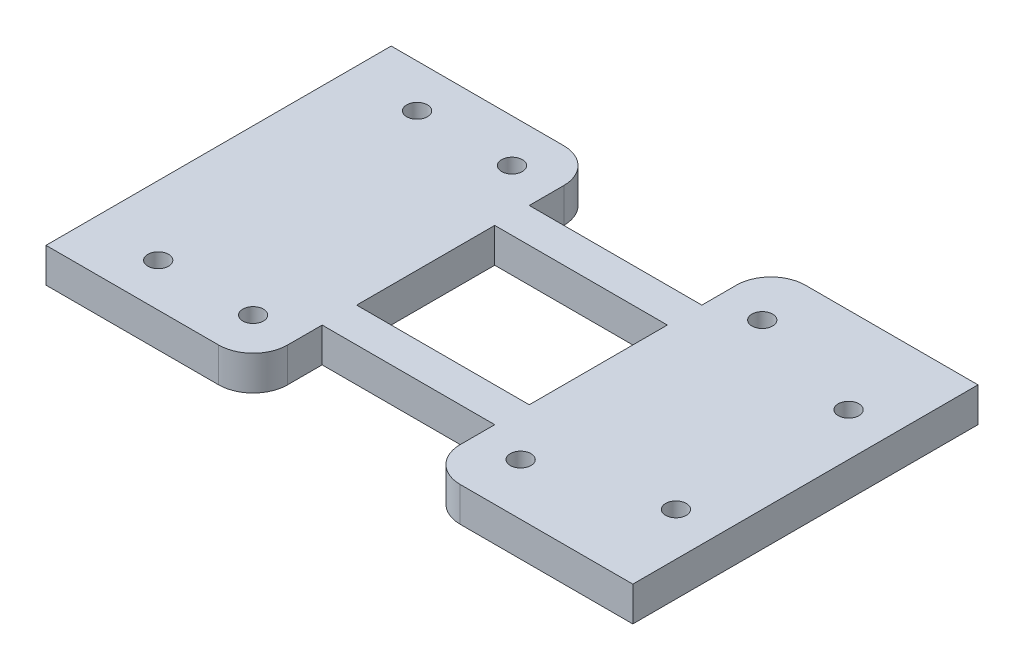
ISO-10303-21;
HEADER;
FILE_DESCRIPTION(('STEP AP214'),'2;1');
FILE_NAME('part.step','',(''),(''),'','','');
FILE_SCHEMA(('AUTOMOTIVE_DESIGN { 1 0 10303 214 1 1 1 1 }'));
ENDSEC;
DATA;
#1=APPLICATION_CONTEXT('core data for automotive mechanical design processes');
#2=APPLICATION_PROTOCOL_DEFINITION('international standard','automotive_design',2000,#1);
#3=PRODUCT_CONTEXT('',#1,'mechanical');
#4=PRODUCT('Part','Part','',(#3));
#5=PRODUCT_RELATED_PRODUCT_CATEGORY('part','',(#4));
#6=PRODUCT_DEFINITION_FORMATION('','',#4);
#7=PRODUCT_DEFINITION_CONTEXT('part definition',#1,'design');
#8=PRODUCT_DEFINITION('design','',#6,#7);
#9=PRODUCT_DEFINITION_SHAPE('','',#8);
#10=(LENGTH_UNIT() NAMED_UNIT(*) SI_UNIT(.MILLI.,.METRE.));
#11=(NAMED_UNIT(*) PLANE_ANGLE_UNIT() SI_UNIT($,.RADIAN.));
#12=(NAMED_UNIT(*) SI_UNIT($,.STERADIAN.) SOLID_ANGLE_UNIT());
#13=UNCERTAINTY_MEASURE_WITH_UNIT(LENGTH_MEASURE(1.E-05),#10,'distance_accuracy_value','');
#14=(GEOMETRIC_REPRESENTATION_CONTEXT(3) GLOBAL_UNCERTAINTY_ASSIGNED_CONTEXT((#13)) GLOBAL_UNIT_ASSIGNED_CONTEXT((#10,
#11,#12)) REPRESENTATION_CONTEXT('',''));
#15=CARTESIAN_POINT('',(0.,0.,0.));
#16=DIRECTION('',(0.,0.,1.));
#17=DIRECTION('',(1.,0.,0.));
#18=AXIS2_PLACEMENT_3D('',#15,#16,#17);
#19=CARTESIAN_POINT('',(17.,-2.,10.));
#20=DIRECTION('',(0.,1.,0.));
#21=DIRECTION('',(-1.,0.,0.));
#22=AXIS2_PLACEMENT_3D('',#19,#20,#21);
#23=PLANE('',#22);
#24=CARTESIAN_POINT('',(-7.5,-2.,-7.5));
#25=DIRECTION('',(0.,-1.,0.));
#26=DIRECTION('',(-1.,0.,0.));
#27=AXIS2_PLACEMENT_3D('',#24,#25,#26);
#28=CIRCLE('',#27,0.6);
#29=CARTESIAN_POINT('',(-8.1,-2.,-7.5));
#30=VERTEX_POINT('',#29);
#31=EDGE_CURVE('E660',#30,#30,#28,.T.);
#32=ORIENTED_EDGE('',*,*,#31,.F.);
#33=EDGE_LOOP('',(#32));
#34=FACE_BOUND('',#33,.T.);
#35=CARTESIAN_POINT('',(-13.,-2.,-7.5));
#36=DIRECTION('',(0.,-1.,0.));
#37=DIRECTION('',(-1.,0.,0.));
#38=AXIS2_PLACEMENT_3D('',#35,#36,#37);
#39=CIRCLE('',#38,0.6);
#40=CARTESIAN_POINT('',(-13.6,-2.,-7.5));
#41=VERTEX_POINT('',#40);
#42=EDGE_CURVE('E662',#41,#41,#39,.T.);
#43=ORIENTED_EDGE('',*,*,#42,.F.);
#44=EDGE_LOOP('',(#43));
#45=FACE_BOUND('',#44,.T.);
#46=CARTESIAN_POINT('',(-13.,-2.,7.5));
#47=DIRECTION('',(0.,-1.,0.));
#48=DIRECTION('',(1.,0.,0.));
#49=AXIS2_PLACEMENT_3D('',#46,#47,#48);
#50=CIRCLE('',#49,0.6);
#51=CARTESIAN_POINT('',(-12.4,-2.,7.5));
#52=VERTEX_POINT('',#51);
#53=EDGE_CURVE('E668',#52,#52,#50,.T.);
#54=ORIENTED_EDGE('',*,*,#53,.F.);
#55=EDGE_LOOP('',(#54));
#56=FACE_BOUND('',#55,.T.);
#57=CARTESIAN_POINT('',(-7.5,-2.,7.5));
#58=DIRECTION('',(0.,-1.,0.));
#59=DIRECTION('',(1.,0.,0.));
#60=AXIS2_PLACEMENT_3D('',#57,#58,#59);
#61=CIRCLE('',#60,0.6);
#62=CARTESIAN_POINT('',(-6.9,-2.,7.5));
#63=VERTEX_POINT('',#62);
#64=EDGE_CURVE('E356',#63,#63,#61,.T.);
#65=ORIENTED_EDGE('',*,*,#64,.F.);
#66=EDGE_LOOP('',(#65));
#67=FACE_BOUND('',#66,.T.);
#68=CARTESIAN_POINT('',(14.5,-2.,5.));
#69=DIRECTION('',(0.,1.,0.));
#70=DIRECTION('',(1.,0.,0.));
#71=AXIS2_PLACEMENT_3D('',#68,#69,#70);
#72=CIRCLE('',#71,0.6);
#73=CARTESIAN_POINT('',(15.1,-2.,5.));
#74=VERTEX_POINT('',#73);
#75=EDGE_CURVE('E353',#74,#74,#72,.T.);
#76=ORIENTED_EDGE('',*,*,#75,.T.);
#77=EDGE_LOOP('',(#76));
#78=FACE_BOUND('',#77,.T.);
#79=CARTESIAN_POINT('',(7.5,-2.,-7.));
#80=DIRECTION('',(0.,1.,0.));
#81=DIRECTION('',(-1.,0.,0.));
#82=AXIS2_PLACEMENT_3D('',#79,#80,#81);
#83=CIRCLE('',#82,0.6);
#84=CARTESIAN_POINT('',(6.9,-2.,-7.));
#85=VERTEX_POINT('',#84);
#86=EDGE_CURVE('E204',#85,#85,#83,.T.);
#87=ORIENTED_EDGE('',*,*,#86,.T.);
#88=EDGE_LOOP('',(#87));
#89=FACE_BOUND('',#88,.T.);
#90=DIRECTION('',(1.,0.,0.));
#91=VECTOR('',#90,1.);
#92=CARTESIAN_POINT('',(-17.,-2.,-10.));
#93=LINE('',#92,#91);
#94=CARTESIAN_POINT('',(-17.,-2.,-10.));
#95=VERTEX_POINT('',#94);
#96=CARTESIAN_POINT('',(-7.,-2.,-10.));
#97=VERTEX_POINT('',#96);
#98=EDGE_CURVE('E218',#95,#97,#93,.T.);
#99=ORIENTED_EDGE('',*,*,#98,.T.);
#100=CARTESIAN_POINT('',(-7.,-2.,-8.));
#101=DIRECTION('',(0.,1.,0.));
#102=DIRECTION('',(-1.,0.,0.));
#103=AXIS2_PLACEMENT_3D('',#100,#101,#102);
#104=CIRCLE('',#103,2.);
#105=CARTESIAN_POINT('',(-5.,-2.,-8.));
#106=VERTEX_POINT('',#105);
#107=EDGE_CURVE('E318',#97,#106,#104,.F.);
#108=ORIENTED_EDGE('',*,*,#107,.T.);
#109=DIRECTION('',(0.,0.,-1.));
#110=VECTOR('',#109,1.);
#111=CARTESIAN_POINT('',(-5.,-2.,10.));
#112=LINE('',#111,#110);
#113=CARTESIAN_POINT('',(-5.,-2.,-6.));
#114=VERTEX_POINT('',#113);
#115=EDGE_CURVE('E237',#114,#106,#112,.T.);
#116=ORIENTED_EDGE('',*,*,#115,.F.);
#117=DIRECTION('',(-1.,0.,0.));
#118=VECTOR('',#117,1.);
#119=CARTESIAN_POINT('',(6.,-2.,-6.));
#120=LINE('',#119,#118);
#121=CARTESIAN_POINT('',(5.,-2.,-6.));
#122=VERTEX_POINT('',#121);
#123=EDGE_CURVE('E243',#122,#114,#120,.T.);
#124=ORIENTED_EDGE('',*,*,#123,.F.);
#125=DIRECTION('',(0.,0.,-1.));
#126=VECTOR('',#125,1.);
#127=CARTESIAN_POINT('',(5.,-2.,10.));
#128=LINE('',#127,#126);
#129=CARTESIAN_POINT('',(5.,-2.,-8.));
#130=VERTEX_POINT('',#129);
#131=EDGE_CURVE('E283',#122,#130,#128,.T.);
#132=ORIENTED_EDGE('',*,*,#131,.T.);
#133=CARTESIAN_POINT('',(7.,-2.,-8.));
#134=DIRECTION('',(0.,1.,0.));
#135=DIRECTION('',(-1.,0.,0.));
#136=AXIS2_PLACEMENT_3D('',#133,#134,#135);
#137=CIRCLE('',#136,2.);
#138=CARTESIAN_POINT('',(7.,-2.,-10.));
#139=VERTEX_POINT('',#138);
#140=EDGE_CURVE('E293',#130,#139,#137,.F.);
#141=ORIENTED_EDGE('',*,*,#140,.T.);
#142=DIRECTION('',(1.,0.,0.));
#143=VECTOR('',#142,1.);
#144=CARTESIAN_POINT('',(17.,-2.,-10.));
#145=LINE('',#144,#143);
#146=CARTESIAN_POINT('',(17.,-2.,-10.));
#147=VERTEX_POINT('',#146);
#148=EDGE_CURVE('E260',#139,#147,#145,.T.);
#149=ORIENTED_EDGE('',*,*,#148,.T.);
#150=DIRECTION('',(0.,0.,-1.));
#151=VECTOR('',#150,1.);
#152=CARTESIAN_POINT('',(17.,-2.,10.));
#153=LINE('',#152,#151);
#154=CARTESIAN_POINT('',(17.,-2.,10.));
#155=VERTEX_POINT('',#154);
#156=EDGE_CURVE('E280',#155,#147,#153,.T.);
#157=ORIENTED_EDGE('',*,*,#156,.F.);
#158=DIRECTION('',(1.,0.,0.));
#159=VECTOR('',#158,1.);
#160=CARTESIAN_POINT('',(17.,-2.,10.));
#161=LINE('',#160,#159);
#162=CARTESIAN_POINT('',(7.,-2.,10.));
#163=VERTEX_POINT('',#162);
#164=EDGE_CURVE('E261',#163,#155,#161,.T.);
#165=ORIENTED_EDGE('',*,*,#164,.F.);
#166=CARTESIAN_POINT('',(7.,-2.,8.));
#167=DIRECTION('',(0.,1.,0.));
#168=DIRECTION('',(-1.,0.,0.));
#169=AXIS2_PLACEMENT_3D('',#166,#167,#168);
#170=CIRCLE('',#169,2.);
#171=CARTESIAN_POINT('',(5.,-2.,8.));
#172=VERTEX_POINT('',#171);
#173=EDGE_CURVE('E295',#163,#172,#170,.F.);
#174=ORIENTED_EDGE('',*,*,#173,.T.);
#175=CARTESIAN_POINT('',(5.,-2.,6.));
#176=VERTEX_POINT('',#175);
#177=EDGE_CURVE('E284',#172,#176,#128,.T.);
#178=ORIENTED_EDGE('',*,*,#177,.T.);
#179=DIRECTION('',(-1.,0.,0.));
#180=VECTOR('',#179,1.);
#181=CARTESIAN_POINT('',(6.,-2.,6.));
#182=LINE('',#181,#180);
#183=CARTESIAN_POINT('',(-5.,-2.,6.));
#184=VERTEX_POINT('',#183);
#185=EDGE_CURVE('E201',#176,#184,#182,.T.);
#186=ORIENTED_EDGE('',*,*,#185,.T.);
#187=CARTESIAN_POINT('',(-5.,-2.,8.));
#188=VERTEX_POINT('',#187);
#189=EDGE_CURVE('E238',#188,#184,#112,.T.);
#190=ORIENTED_EDGE('',*,*,#189,.F.);
#191=CARTESIAN_POINT('',(-7.,-2.,8.));
#192=DIRECTION('',(0.,1.,0.));
#193=DIRECTION('',(-1.,0.,0.));
#194=AXIS2_PLACEMENT_3D('',#191,#192,#193);
#195=CIRCLE('',#194,2.);
#196=CARTESIAN_POINT('',(-7.,-2.,10.));
#197=VERTEX_POINT('',#196);
#198=EDGE_CURVE('E50',#188,#197,#195,.F.);
#199=ORIENTED_EDGE('',*,*,#198,.T.);
#200=DIRECTION('',(1.,0.,0.));
#201=VECTOR('',#200,1.);
#202=CARTESIAN_POINT('',(-17.,-2.,10.));
#203=LINE('',#202,#201);
#204=CARTESIAN_POINT('',(-17.,-2.,10.));
#205=VERTEX_POINT('',#204);
#206=EDGE_CURVE('E219',#205,#197,#203,.T.);
#207=ORIENTED_EDGE('',*,*,#206,.F.);
#208=DIRECTION('',(0.,0.,-1.));
#209=VECTOR('',#208,1.);
#210=CARTESIAN_POINT('',(-17.,-2.,10.));
#211=LINE('',#210,#209);
#212=EDGE_CURVE('E226',#205,#95,#211,.T.);
#213=ORIENTED_EDGE('',*,*,#212,.T.);
#214=EDGE_LOOP('',(#99,#108,#116,#124,#132,#141,#149,#157,#165,#174,#178,#186,#190,#199,#207,#213));
#215=FACE_BOUND('',#214,.T.);
#216=DIRECTION('',(-1.,0.,0.));
#217=VECTOR('',#216,1.);
#218=CARTESIAN_POINT('',(6.,-2.,4.));
#219=LINE('',#218,#217);
#220=CARTESIAN_POINT('',(5.,-2.,4.));
#221=VERTEX_POINT('',#220);
#222=CARTESIAN_POINT('',(-5.,-2.,4.));
#223=VERTEX_POINT('',#222);
#224=EDGE_CURVE('E192',#221,#223,#219,.T.);
#225=ORIENTED_EDGE('',*,*,#224,.F.);
#226=CARTESIAN_POINT('',(5.,-2.,-4.));
#227=VERTEX_POINT('',#226);
#228=EDGE_CURVE('E286',#221,#227,#128,.T.);
#229=ORIENTED_EDGE('',*,*,#228,.T.);
#230=DIRECTION('',(-1.,0.,0.));
#231=VECTOR('',#230,1.);
#232=CARTESIAN_POINT('',(6.,-2.,-4.));
#233=LINE('',#232,#231);
#234=CARTESIAN_POINT('',(-5.,-2.,-4.));
#235=VERTEX_POINT('',#234);
#236=EDGE_CURVE('E246',#227,#235,#233,.T.);
#237=ORIENTED_EDGE('',*,*,#236,.T.);
#238=EDGE_CURVE('E241',#223,#235,#112,.T.);
#239=ORIENTED_EDGE('',*,*,#238,.F.);
#240=EDGE_LOOP('',(#225,#229,#237,#239));
#241=FACE_BOUND('',#240,.T.);
#242=CARTESIAN_POINT('',(14.5,-2.,-5.));
#243=DIRECTION('',(0.,1.,0.));
#244=DIRECTION('',(-1.,0.,0.));
#245=AXIS2_PLACEMENT_3D('',#242,#243,#244);
#246=CIRCLE('',#245,0.6);
#247=CARTESIAN_POINT('',(13.9,-2.,-5.));
#248=VERTEX_POINT('',#247);
#249=EDGE_CURVE('E344',#248,#248,#246,.T.);
#250=ORIENTED_EDGE('',*,*,#249,.T.);
#251=EDGE_LOOP('',(#250));
#252=FACE_BOUND('',#251,.T.);
#253=CARTESIAN_POINT('',(7.5,-2.,7.));
#254=DIRECTION('',(0.,1.,0.));
#255=DIRECTION('',(1.,0.,0.));
#256=AXIS2_PLACEMENT_3D('',#253,#254,#255);
#257=CIRCLE('',#256,0.6);
#258=CARTESIAN_POINT('',(8.1,-2.,7.));
#259=VERTEX_POINT('',#258);
#260=EDGE_CURVE('E347',#259,#259,#257,.T.);
#261=ORIENTED_EDGE('',*,*,#260,.T.);
#262=EDGE_LOOP('',(#261));
#263=FACE_BOUND('',#262,.T.);
#264=ADVANCED_FACE('F35',(#34,#45,#56,#67,#78,#89,#215,#241,#252,#263),#23,.F.);
#265=CARTESIAN_POINT('',(5.,0.,10.));
#266=DIRECTION('',(0.,-1.,0.));
#267=DIRECTION('',(1.,0.,0.));
#268=AXIS2_PLACEMENT_3D('',#265,#266,#267);
#269=PLANE('',#268);
#270=CARTESIAN_POINT('',(-7.5,0.,-7.5));
#271=DIRECTION('',(0.,-1.,0.));
#272=DIRECTION('',(-1.,0.,0.));
#273=AXIS2_PLACEMENT_3D('',#270,#271,#272);
#274=CIRCLE('',#273,0.6);
#275=CARTESIAN_POINT('',(-8.1,0.,-7.5));
#276=VERTEX_POINT('',#275);
#277=EDGE_CURVE('E657',#276,#276,#274,.T.);
#278=ORIENTED_EDGE('',*,*,#277,.T.);
#279=EDGE_LOOP('',(#278));
#280=FACE_BOUND('',#279,.T.);
#281=CARTESIAN_POINT('',(-13.,0.,-7.5));
#282=DIRECTION('',(0.,-1.,0.));
#283=DIRECTION('',(-1.,0.,0.));
#284=AXIS2_PLACEMENT_3D('',#281,#282,#283);
#285=CIRCLE('',#284,0.6);
#286=CARTESIAN_POINT('',(-13.6,0.,-7.5));
#287=VERTEX_POINT('',#286);
#288=EDGE_CURVE('E665',#287,#287,#285,.T.);
#289=ORIENTED_EDGE('',*,*,#288,.T.);
#290=EDGE_LOOP('',(#289));
#291=FACE_BOUND('',#290,.T.);
#292=CARTESIAN_POINT('',(-13.,0.,7.5));
#293=DIRECTION('',(0.,-1.,0.));
#294=DIRECTION('',(1.,0.,0.));
#295=AXIS2_PLACEMENT_3D('',#292,#293,#294);
#296=CIRCLE('',#295,0.6);
#297=CARTESIAN_POINT('',(-12.4,0.,7.5));
#298=VERTEX_POINT('',#297);
#299=EDGE_CURVE('E671',#298,#298,#296,.T.);
#300=ORIENTED_EDGE('',*,*,#299,.T.);
#301=EDGE_LOOP('',(#300));
#302=FACE_BOUND('',#301,.T.);
#303=CARTESIAN_POINT('',(-7.5,0.,7.5));
#304=DIRECTION('',(0.,-1.,0.));
#305=DIRECTION('',(1.,0.,0.));
#306=AXIS2_PLACEMENT_3D('',#303,#304,#305);
#307=CIRCLE('',#306,0.6);
#308=CARTESIAN_POINT('',(-6.9,0.,7.5));
#309=VERTEX_POINT('',#308);
#310=EDGE_CURVE('E350',#309,#309,#307,.T.);
#311=ORIENTED_EDGE('',*,*,#310,.T.);
#312=EDGE_LOOP('',(#311));
#313=FACE_BOUND('',#312,.T.);
#314=CARTESIAN_POINT('',(14.5,0.,5.));
#315=DIRECTION('',(0.,1.,0.));
#316=DIRECTION('',(1.,0.,0.));
#317=AXIS2_PLACEMENT_3D('',#314,#315,#316);
#318=CIRCLE('',#317,0.6);
#319=CARTESIAN_POINT('',(15.1,0.,5.));
#320=VERTEX_POINT('',#319);
#321=EDGE_CURVE('E360',#320,#320,#318,.T.);
#322=ORIENTED_EDGE('',*,*,#321,.F.);
#323=EDGE_LOOP('',(#322));
#324=FACE_BOUND('',#323,.T.);
#325=CARTESIAN_POINT('',(7.5,0.,-7.));
#326=DIRECTION('',(0.,1.,0.));
#327=DIRECTION('',(-1.,0.,0.));
#328=AXIS2_PLACEMENT_3D('',#325,#326,#327);
#329=CIRCLE('',#328,0.6);
#330=CARTESIAN_POINT('',(6.9,0.,-7.));
#331=VERTEX_POINT('',#330);
#332=EDGE_CURVE('E199',#331,#331,#329,.T.);
#333=ORIENTED_EDGE('',*,*,#332,.F.);
#334=EDGE_LOOP('',(#333));
#335=FACE_BOUND('',#334,.T.);
#336=DIRECTION('',(0.,0.,-1.));
#337=VECTOR('',#336,1.);
#338=CARTESIAN_POINT('',(5.,0.,10.));
#339=LINE('',#338,#337);
#340=CARTESIAN_POINT('',(5.,0.,4.));
#341=VERTEX_POINT('',#340);
#342=CARTESIAN_POINT('',(5.,0.,-4.));
#343=VERTEX_POINT('',#342);
#344=EDGE_CURVE('E198',#341,#343,#339,.T.);
#345=ORIENTED_EDGE('',*,*,#344,.F.);
#346=DIRECTION('',(-1.,0.,0.));
#347=VECTOR('',#346,1.);
#348=CARTESIAN_POINT('',(6.,0.,4.));
#349=LINE('',#348,#347);
#350=CARTESIAN_POINT('',(-5.,0.,4.));
#351=VERTEX_POINT('',#350);
#352=EDGE_CURVE('E190',#341,#351,#349,.T.);
#353=ORIENTED_EDGE('',*,*,#352,.T.);
#354=DIRECTION('',(0.,0.,-1.));
#355=VECTOR('',#354,1.);
#356=CARTESIAN_POINT('',(-5.,0.,10.));
#357=LINE('',#356,#355);
#358=CARTESIAN_POINT('',(-5.,0.,-4.));
#359=VERTEX_POINT('',#358);
#360=EDGE_CURVE('E171',#351,#359,#357,.T.);
#361=ORIENTED_EDGE('',*,*,#360,.T.);
#362=DIRECTION('',(-1.,0.,0.));
#363=VECTOR('',#362,1.);
#364=CARTESIAN_POINT('',(6.,0.,-4.));
#365=LINE('',#364,#363);
#366=EDGE_CURVE('E249',#343,#359,#365,.T.);
#367=ORIENTED_EDGE('',*,*,#366,.F.);
#368=EDGE_LOOP('',(#345,#353,#361,#367));
#369=FACE_BOUND('',#368,.T.);
#370=CARTESIAN_POINT('',(-5.,0.,-6.));
#371=VERTEX_POINT('',#370);
#372=CARTESIAN_POINT('',(-5.,0.,-8.));
#373=VERTEX_POINT('',#372);
#374=EDGE_CURVE('E183',#371,#373,#357,.T.);
#375=ORIENTED_EDGE('',*,*,#374,.T.);
#376=CARTESIAN_POINT('',(-7.,0.,-8.));
#377=DIRECTION('',(0.,-1.,0.));
#378=DIRECTION('',(1.,0.,0.));
#379=AXIS2_PLACEMENT_3D('',#376,#377,#378);
#380=CIRCLE('',#379,2.);
#381=CARTESIAN_POINT('',(-7.,0.,-10.));
#382=VERTEX_POINT('',#381);
#383=EDGE_CURVE('E313',#373,#382,#380,.F.);
#384=ORIENTED_EDGE('',*,*,#383,.T.);
#385=DIRECTION('',(-1.,0.,0.));
#386=VECTOR('',#385,1.);
#387=CARTESIAN_POINT('',(-5.,0.,-10.));
#388=LINE('',#387,#386);
#389=CARTESIAN_POINT('',(-17.,0.,-10.));
#390=VERTEX_POINT('',#389);
#391=EDGE_CURVE('E229',#382,#390,#388,.T.);
#392=ORIENTED_EDGE('',*,*,#391,.T.);
#393=DIRECTION('',(0.,0.,-1.));
#394=VECTOR('',#393,1.);
#395=CARTESIAN_POINT('',(-17.,0.,10.));
#396=LINE('',#395,#394);
#397=CARTESIAN_POINT('',(-17.,0.,10.));
#398=VERTEX_POINT('',#397);
#399=EDGE_CURVE('E234',#398,#390,#396,.T.);
#400=ORIENTED_EDGE('',*,*,#399,.F.);
#401=DIRECTION('',(-1.,0.,0.));
#402=VECTOR('',#401,1.);
#403=CARTESIAN_POINT('',(-5.,0.,10.));
#404=LINE('',#403,#402);
#405=CARTESIAN_POINT('',(-7.,0.,10.));
#406=VERTEX_POINT('',#405);
#407=EDGE_CURVE('E221',#406,#398,#404,.T.);
#408=ORIENTED_EDGE('',*,*,#407,.F.);
#409=CARTESIAN_POINT('',(-7.,0.,8.));
#410=DIRECTION('',(0.,-1.,0.));
#411=DIRECTION('',(1.,0.,0.));
#412=AXIS2_PLACEMENT_3D('',#409,#410,#411);
#413=CIRCLE('',#412,2.);
#414=CARTESIAN_POINT('',(-5.,0.,8.));
#415=VERTEX_POINT('',#414);
#416=EDGE_CURVE('E311',#406,#415,#413,.F.);
#417=ORIENTED_EDGE('',*,*,#416,.T.);
#418=CARTESIAN_POINT('',(-5.,0.,6.));
#419=VERTEX_POINT('',#418);
#420=EDGE_CURVE('E182',#415,#419,#357,.T.);
#421=ORIENTED_EDGE('',*,*,#420,.T.);
#422=DIRECTION('',(-1.,0.,0.));
#423=VECTOR('',#422,1.);
#424=CARTESIAN_POINT('',(6.,0.,6.));
#425=LINE('',#424,#423);
#426=CARTESIAN_POINT('',(5.,0.,6.));
#427=VERTEX_POINT('',#426);
#428=EDGE_CURVE('E210',#427,#419,#425,.T.);
#429=ORIENTED_EDGE('',*,*,#428,.F.);
#430=CARTESIAN_POINT('',(5.,0.,8.));
#431=VERTEX_POINT('',#430);
#432=EDGE_CURVE('E275',#431,#427,#339,.T.);
#433=ORIENTED_EDGE('',*,*,#432,.F.);
#434=CARTESIAN_POINT('',(7.,0.,8.));
#435=DIRECTION('',(0.,-1.,0.));
#436=DIRECTION('',(1.,0.,0.));
#437=AXIS2_PLACEMENT_3D('',#434,#435,#436);
#438=CIRCLE('',#437,2.);
#439=CARTESIAN_POINT('',(7.,0.,10.));
#440=VERTEX_POINT('',#439);
#441=EDGE_CURVE('E301',#431,#440,#438,.F.);
#442=ORIENTED_EDGE('',*,*,#441,.T.);
#443=DIRECTION('',(-1.,0.,0.));
#444=VECTOR('',#443,1.);
#445=CARTESIAN_POINT('',(5.,0.,10.));
#446=LINE('',#445,#444);
#447=CARTESIAN_POINT('',(17.,0.,10.));
#448=VERTEX_POINT('',#447);
#449=EDGE_CURVE('E266',#448,#440,#446,.T.);
#450=ORIENTED_EDGE('',*,*,#449,.F.);
#451=DIRECTION('',(0.,0.,-1.));
#452=VECTOR('',#451,1.);
#453=CARTESIAN_POINT('',(17.,0.,10.));
#454=LINE('',#453,#452);
#455=CARTESIAN_POINT('',(17.,0.,-10.));
#456=VERTEX_POINT('',#455);
#457=EDGE_CURVE('E277',#448,#456,#454,.T.);
#458=ORIENTED_EDGE('',*,*,#457,.T.);
#459=DIRECTION('',(-1.,0.,0.));
#460=VECTOR('',#459,1.);
#461=CARTESIAN_POINT('',(5.,0.,-10.));
#462=LINE('',#461,#460);
#463=CARTESIAN_POINT('',(7.,0.,-10.));
#464=VERTEX_POINT('',#463);
#465=EDGE_CURVE('E264',#456,#464,#462,.T.);
#466=ORIENTED_EDGE('',*,*,#465,.T.);
#467=CARTESIAN_POINT('',(7.,0.,-8.));
#468=DIRECTION('',(0.,-1.,0.));
#469=DIRECTION('',(1.,0.,0.));
#470=AXIS2_PLACEMENT_3D('',#467,#468,#469);
#471=CIRCLE('',#470,2.);
#472=CARTESIAN_POINT('',(5.,0.,-8.));
#473=VERTEX_POINT('',#472);
#474=EDGE_CURVE('E299',#464,#473,#471,.F.);
#475=ORIENTED_EDGE('',*,*,#474,.T.);
#476=CARTESIAN_POINT('',(5.,0.,-6.));
#477=VERTEX_POINT('',#476);
#478=EDGE_CURVE('E269',#477,#473,#339,.T.);
#479=ORIENTED_EDGE('',*,*,#478,.F.);
#480=DIRECTION('',(-1.,0.,0.));
#481=VECTOR('',#480,1.);
#482=CARTESIAN_POINT('',(6.,0.,-6.));
#483=LINE('',#482,#481);
#484=EDGE_CURVE('E251',#477,#371,#483,.T.);
#485=ORIENTED_EDGE('',*,*,#484,.T.);
#486=EDGE_LOOP('',(#375,#384,#392,#400,#408,#417,#421,#429,#433,#442,#450,#458,#466,#475,#479,#485));
#487=FACE_BOUND('',#486,.T.);
#488=CARTESIAN_POINT('',(14.5,0.,-5.));
#489=DIRECTION('',(0.,1.,0.));
#490=DIRECTION('',(-1.,0.,0.));
#491=AXIS2_PLACEMENT_3D('',#488,#489,#490);
#492=CIRCLE('',#491,0.6);
#493=CARTESIAN_POINT('',(13.9,0.,-5.));
#494=VERTEX_POINT('',#493);
#495=EDGE_CURVE('E365',#494,#494,#492,.T.);
#496=ORIENTED_EDGE('',*,*,#495,.F.);
#497=EDGE_LOOP('',(#496));
#498=FACE_BOUND('',#497,.T.);
#499=CARTESIAN_POINT('',(7.5,0.,7.));
#500=DIRECTION('',(0.,1.,0.));
#501=DIRECTION('',(1.,0.,0.));
#502=AXIS2_PLACEMENT_3D('',#499,#500,#501);
#503=CIRCLE('',#502,0.6);
#504=CARTESIAN_POINT('',(8.1,0.,7.));
#505=VERTEX_POINT('',#504);
#506=EDGE_CURVE('E349',#505,#505,#503,.T.);
#507=ORIENTED_EDGE('',*,*,#506,.F.);
#508=EDGE_LOOP('',(#507));
#509=FACE_BOUND('',#508,.T.);
#510=ADVANCED_FACE('F196',(#280,#291,#302,#313,#324,#335,#369,#487,#498,#509),#269,.F.);
#511=CARTESIAN_POINT('',(5.,0.,10.));
#512=DIRECTION('',(1.,0.,0.));
#513=DIRECTION('',(0.,0.,-1.));
#514=AXIS2_PLACEMENT_3D('',#511,#512,#513);
#515=PLANE('',#514);
#516=ORIENTED_EDGE('',*,*,#177,.F.);
#517=DIRECTION('',(0.,-1.,0.));
#518=VECTOR('',#517,1.);
#519=CARTESIAN_POINT('',(5.,0.,8.));
#520=LINE('',#519,#518);
#521=EDGE_CURVE('E297',#172,#431,#520,.F.);
#522=ORIENTED_EDGE('',*,*,#521,.T.);
#523=ORIENTED_EDGE('',*,*,#432,.T.);
#524=DIRECTION('',(0.,1.,0.));
#525=VECTOR('',#524,1.);
#526=CARTESIAN_POINT('',(5.,0.,6.));
#527=LINE('',#526,#525);
#528=EDGE_CURVE('E215',#176,#427,#527,.T.);
#529=ORIENTED_EDGE('',*,*,#528,.F.);
#530=EDGE_LOOP('',(#516,#522,#523,#529));
#531=FACE_BOUND('',#530,.T.);
#532=ADVANCED_FACE('F425',(#531),#515,.F.);
#533=DIRECTION('',(0.,-1.,0.));
#534=VECTOR('',#533,1.);
#535=CARTESIAN_POINT('',(5.,0.,4.));
#536=LINE('',#535,#534);
#537=EDGE_CURVE('E213',#341,#221,#536,.T.);
#538=ORIENTED_EDGE('',*,*,#537,.F.);
#539=ORIENTED_EDGE('',*,*,#344,.T.);
#540=DIRECTION('',(0.,1.,0.));
#541=VECTOR('',#540,1.);
#542=CARTESIAN_POINT('',(5.,0.,-4.));
#543=LINE('',#542,#541);
#544=EDGE_CURVE('E254',#227,#343,#543,.T.);
#545=ORIENTED_EDGE('',*,*,#544,.F.);
#546=ORIENTED_EDGE('',*,*,#228,.F.);
#547=EDGE_LOOP('',(#538,#539,#545,#546));
#548=FACE_BOUND('',#547,.T.);
#549=ADVANCED_FACE('F433',(#548),#515,.F.);
#550=CARTESIAN_POINT('',(-5.,-2.,10.));
#551=DIRECTION('',(-1.,0.,0.));
#552=DIRECTION('',(0.,0.,1.));
#553=AXIS2_PLACEMENT_3D('',#550,#551,#552);
#554=PLANE('',#553);
#555=ORIENTED_EDGE('',*,*,#420,.F.);
#556=DIRECTION('',(0.,1.,0.));
#557=VECTOR('',#556,1.);
#558=CARTESIAN_POINT('',(-5.,-2.,8.));
#559=LINE('',#558,#557);
#560=EDGE_CURVE('E12',#415,#188,#559,.F.);
#561=ORIENTED_EDGE('',*,*,#560,.T.);
#562=ORIENTED_EDGE('',*,*,#189,.T.);
#563=DIRECTION('',(0.,-1.,0.));
#564=VECTOR('',#563,1.);
#565=CARTESIAN_POINT('',(-5.,-2.,6.));
#566=LINE('',#565,#564);
#567=EDGE_CURVE('E193',#419,#184,#566,.T.);
#568=ORIENTED_EDGE('',*,*,#567,.F.);
#569=EDGE_LOOP('',(#555,#561,#562,#568));
#570=FACE_BOUND('',#569,.T.);
#571=ADVANCED_FACE('F405',(#570),#554,.F.);
#572=DIRECTION('',(0.,1.,0.));
#573=VECTOR('',#572,1.);
#574=CARTESIAN_POINT('',(-5.,-2.,4.));
#575=LINE('',#574,#573);
#576=EDGE_CURVE('E174',#223,#351,#575,.T.);
#577=ORIENTED_EDGE('',*,*,#576,.F.);
#578=ORIENTED_EDGE('',*,*,#238,.T.);
#579=DIRECTION('',(0.,1.,0.));
#580=VECTOR('',#579,1.);
#581=CARTESIAN_POINT('',(-5.,0.,-4.));
#582=LINE('',#581,#580);
#583=EDGE_CURVE('E177',#235,#359,#582,.T.);
#584=ORIENTED_EDGE('',*,*,#583,.T.);
#585=ORIENTED_EDGE('',*,*,#360,.F.);
#586=EDGE_LOOP('',(#577,#578,#584,#585));
#587=FACE_BOUND('',#586,.T.);
#588=ADVANCED_FACE('F173',(#587),#554,.F.);
#589=CARTESIAN_POINT('',(6.,0.,-6.));
#590=DIRECTION('',(0.,0.,1.));
#591=DIRECTION('',(1.,0.,0.));
#592=AXIS2_PLACEMENT_3D('',#589,#590,#591);
#593=PLANE('',#592);
#594=DIRECTION('',(0.,-1.,0.));
#595=VECTOR('',#594,1.);
#596=CARTESIAN_POINT('',(-5.,0.,-6.));
#597=LINE('',#596,#595);
#598=EDGE_CURVE('E240',#371,#114,#597,.T.);
#599=ORIENTED_EDGE('',*,*,#598,.F.);
#600=ORIENTED_EDGE('',*,*,#484,.F.);
#601=DIRECTION('',(0.,-1.,0.));
#602=VECTOR('',#601,1.);
#603=CARTESIAN_POINT('',(5.,0.,-6.));
#604=LINE('',#603,#602);
#605=EDGE_CURVE('E257',#477,#122,#604,.T.);
#606=ORIENTED_EDGE('',*,*,#605,.T.);
#607=ORIENTED_EDGE('',*,*,#123,.T.);
#608=EDGE_LOOP('',(#599,#600,#606,#607));
#609=FACE_BOUND('',#608,.T.);
#610=ADVANCED_FACE('F410',(#609),#593,.F.);
#611=CARTESIAN_POINT('',(6.,0.,-4.));
#612=DIRECTION('',(0.,0.,-1.));
#613=DIRECTION('',(-1.,0.,0.));
#614=AXIS2_PLACEMENT_3D('',#611,#612,#613);
#615=PLANE('',#614);
#616=ORIENTED_EDGE('',*,*,#583,.F.);
#617=ORIENTED_EDGE('',*,*,#236,.F.);
#618=ORIENTED_EDGE('',*,*,#544,.T.);
#619=ORIENTED_EDGE('',*,*,#366,.T.);
#620=EDGE_LOOP('',(#616,#617,#618,#619));
#621=FACE_BOUND('',#620,.T.);
#622=ADVANCED_FACE('F406',(#621),#615,.F.);
#623=ORIENTED_EDGE('',*,*,#478,.T.);
#624=DIRECTION('',(0.,-1.,0.));
#625=VECTOR('',#624,1.);
#626=CARTESIAN_POINT('',(5.,-2.,-8.));
#627=LINE('',#626,#625);
#628=EDGE_CURVE('E303',#473,#130,#627,.T.);
#629=ORIENTED_EDGE('',*,*,#628,.T.);
#630=ORIENTED_EDGE('',*,*,#131,.F.);
#631=ORIENTED_EDGE('',*,*,#605,.F.);
#632=EDGE_LOOP('',(#623,#629,#630,#631));
#633=FACE_BOUND('',#632,.T.);
#634=ADVANCED_FACE('F409',(#633),#515,.F.);
#635=CARTESIAN_POINT('',(17.,0.,10.));
#636=DIRECTION('',(-1.,0.,0.));
#637=DIRECTION('',(0.,0.,1.));
#638=AXIS2_PLACEMENT_3D('',#635,#636,#637);
#639=PLANE('',#638);
#640=DIRECTION('',(0.,1.,0.));
#641=VECTOR('',#640,1.);
#642=CARTESIAN_POINT('',(17.,0.,-10.));
#643=LINE('',#642,#641);
#644=EDGE_CURVE('E271',#147,#456,#643,.T.);
#645=ORIENTED_EDGE('',*,*,#644,.T.);
#646=ORIENTED_EDGE('',*,*,#457,.F.);
#647=DIRECTION('',(0.,1.,0.));
#648=VECTOR('',#647,1.);
#649=CARTESIAN_POINT('',(17.,0.,10.));
#650=LINE('',#649,#648);
#651=EDGE_CURVE('E263',#155,#448,#650,.T.);
#652=ORIENTED_EDGE('',*,*,#651,.F.);
#653=ORIENTED_EDGE('',*,*,#156,.T.);
#654=EDGE_LOOP('',(#645,#646,#652,#653));
#655=FACE_BOUND('',#654,.T.);
#656=ADVANCED_FACE('F418',(#655),#639,.F.);
#657=CARTESIAN_POINT('',(0.,0.,10.));
#658=DIRECTION('',(0.,0.,-1.));
#659=DIRECTION('',(-1.,0.,0.));
#660=AXIS2_PLACEMENT_3D('',#657,#658,#659);
#661=PLANE('',#660);
#662=ORIENTED_EDGE('',*,*,#449,.T.);
#663=DIRECTION('',(0.,-1.,0.));
#664=VECTOR('',#663,1.);
#665=CARTESIAN_POINT('',(7.,0.,10.));
#666=LINE('',#665,#664);
#667=EDGE_CURVE('E290',#440,#163,#666,.T.);
#668=ORIENTED_EDGE('',*,*,#667,.T.);
#669=ORIENTED_EDGE('',*,*,#164,.T.);
#670=ORIENTED_EDGE('',*,*,#651,.T.);
#671=EDGE_LOOP('',(#662,#668,#669,#670));
#672=FACE_BOUND('',#671,.T.);
#673=ADVANCED_FACE('F415',(#672),#661,.F.);
#674=CARTESIAN_POINT('',(0.,0.,-10.));
#675=DIRECTION('',(0.,0.,-1.));
#676=DIRECTION('',(-1.,0.,0.));
#677=AXIS2_PLACEMENT_3D('',#674,#675,#676);
#678=PLANE('',#677);
#679=ORIENTED_EDGE('',*,*,#148,.F.);
#680=DIRECTION('',(0.,-1.,0.));
#681=VECTOR('',#680,1.);
#682=CARTESIAN_POINT('',(7.,0.,-10.));
#683=LINE('',#682,#681);
#684=EDGE_CURVE('E306',#139,#464,#683,.F.);
#685=ORIENTED_EDGE('',*,*,#684,.T.);
#686=ORIENTED_EDGE('',*,*,#465,.F.);
#687=ORIENTED_EDGE('',*,*,#644,.F.);
#688=EDGE_LOOP('',(#679,#685,#686,#687));
#689=FACE_BOUND('',#688,.T.);
#690=ADVANCED_FACE('F403',(#689),#678,.T.);
#691=ORIENTED_EDGE('',*,*,#115,.T.);
#692=DIRECTION('',(0.,1.,0.));
#693=VECTOR('',#692,1.);
#694=CARTESIAN_POINT('',(-5.,-2.,-8.));
#695=LINE('',#694,#693);
#696=EDGE_CURVE('E308',#106,#373,#695,.T.);
#697=ORIENTED_EDGE('',*,*,#696,.T.);
#698=ORIENTED_EDGE('',*,*,#374,.F.);
#699=ORIENTED_EDGE('',*,*,#598,.T.);
#700=EDGE_LOOP('',(#691,#697,#698,#699));
#701=FACE_BOUND('',#700,.T.);
#702=ADVANCED_FACE('F400',(#701),#554,.F.);
#703=CARTESIAN_POINT('',(-17.,0.,10.));
#704=DIRECTION('',(1.,0.,0.));
#705=DIRECTION('',(0.,0.,-1.));
#706=AXIS2_PLACEMENT_3D('',#703,#704,#705);
#707=PLANE('',#706);
#708=DIRECTION('',(0.,-1.,0.));
#709=VECTOR('',#708,1.);
#710=CARTESIAN_POINT('',(-17.,0.,-10.));
#711=LINE('',#710,#709);
#712=EDGE_CURVE('E222',#390,#95,#711,.T.);
#713=ORIENTED_EDGE('',*,*,#712,.T.);
#714=ORIENTED_EDGE('',*,*,#212,.F.);
#715=DIRECTION('',(0.,-1.,0.));
#716=VECTOR('',#715,1.);
#717=CARTESIAN_POINT('',(-17.,0.,10.));
#718=LINE('',#717,#716);
#719=EDGE_CURVE('E224',#398,#205,#718,.T.);
#720=ORIENTED_EDGE('',*,*,#719,.F.);
#721=ORIENTED_EDGE('',*,*,#399,.T.);
#722=EDGE_LOOP('',(#713,#714,#720,#721));
#723=FACE_BOUND('',#722,.T.);
#724=ADVANCED_FACE('F333',(#723),#707,.F.);
#725=CARTESIAN_POINT('',(0.,0.,10.));
#726=DIRECTION('',(0.,0.,1.));
#727=DIRECTION('',(1.,0.,0.));
#728=AXIS2_PLACEMENT_3D('',#725,#726,#727);
#729=PLANE('',#728);
#730=ORIENTED_EDGE('',*,*,#206,.T.);
#731=DIRECTION('',(0.,1.,0.));
#732=VECTOR('',#731,1.);
#733=CARTESIAN_POINT('',(-7.,0.,10.));
#734=LINE('',#733,#732);
#735=EDGE_CURVE('E43',#197,#406,#734,.T.);
#736=ORIENTED_EDGE('',*,*,#735,.T.);
#737=ORIENTED_EDGE('',*,*,#407,.T.);
#738=ORIENTED_EDGE('',*,*,#719,.T.);
#739=EDGE_LOOP('',(#730,#736,#737,#738));
#740=FACE_BOUND('',#739,.T.);
#741=ADVANCED_FACE('F323',(#740),#729,.T.);
#742=CARTESIAN_POINT('',(0.,0.,-10.));
#743=DIRECTION('',(0.,0.,1.));
#744=DIRECTION('',(1.,0.,0.));
#745=AXIS2_PLACEMENT_3D('',#742,#743,#744);
#746=PLANE('',#745);
#747=ORIENTED_EDGE('',*,*,#391,.F.);
#748=DIRECTION('',(0.,1.,0.));
#749=VECTOR('',#748,1.);
#750=CARTESIAN_POINT('',(-7.,0.,-10.));
#751=LINE('',#750,#749);
#752=EDGE_CURVE('E315',#382,#97,#751,.F.);
#753=ORIENTED_EDGE('',*,*,#752,.T.);
#754=ORIENTED_EDGE('',*,*,#98,.F.);
#755=ORIENTED_EDGE('',*,*,#712,.F.);
#756=EDGE_LOOP('',(#747,#753,#754,#755));
#757=FACE_BOUND('',#756,.T.);
#758=ADVANCED_FACE('F391',(#757),#746,.F.);
#759=CARTESIAN_POINT('',(6.,0.,6.));
#760=DIRECTION('',(0.,0.,-1.));
#761=DIRECTION('',(-1.,0.,0.));
#762=AXIS2_PLACEMENT_3D('',#759,#760,#761);
#763=PLANE('',#762);
#764=ORIENTED_EDGE('',*,*,#185,.F.);
#765=ORIENTED_EDGE('',*,*,#528,.T.);
#766=ORIENTED_EDGE('',*,*,#428,.T.);
#767=ORIENTED_EDGE('',*,*,#567,.T.);
#768=EDGE_LOOP('',(#764,#765,#766,#767));
#769=FACE_BOUND('',#768,.T.);
#770=ADVANCED_FACE('F385',(#769),#763,.F.);
#771=CARTESIAN_POINT('',(6.,0.,4.));
#772=DIRECTION('',(0.,0.,1.));
#773=DIRECTION('',(1.,0.,0.));
#774=AXIS2_PLACEMENT_3D('',#771,#772,#773);
#775=PLANE('',#774);
#776=ORIENTED_EDGE('',*,*,#352,.F.);
#777=ORIENTED_EDGE('',*,*,#537,.T.);
#778=ORIENTED_EDGE('',*,*,#224,.T.);
#779=ORIENTED_EDGE('',*,*,#576,.T.);
#780=EDGE_LOOP('',(#776,#777,#778,#779));
#781=FACE_BOUND('',#780,.T.);
#782=ADVANCED_FACE('F188',(#781),#775,.F.);
#783=CARTESIAN_POINT('',(7.5,0.,-7.));
#784=DIRECTION('',(0.,-1.,0.));
#785=DIRECTION('',(1.,0.,0.));
#786=AXIS2_PLACEMENT_3D('',#783,#784,#785);
#787=CYLINDRICAL_SURFACE('',#786,0.6);
#788=ORIENTED_EDGE('',*,*,#332,.T.);
#789=EDGE_LOOP('',(#788));
#790=FACE_BOUND('',#789,.T.);
#791=ORIENTED_EDGE('',*,*,#86,.F.);
#792=EDGE_LOOP('',(#791));
#793=FACE_BOUND('',#792,.T.);
#794=ADVANCED_FACE('F374',(#790,#793),#787,.F.);
#795=CARTESIAN_POINT('',(14.5,0.,-5.));
#796=DIRECTION('',(0.,-1.,0.));
#797=DIRECTION('',(1.,0.,0.));
#798=AXIS2_PLACEMENT_3D('',#795,#796,#797);
#799=CYLINDRICAL_SURFACE('',#798,0.6);
#800=ORIENTED_EDGE('',*,*,#495,.T.);
#801=EDGE_LOOP('',(#800));
#802=FACE_BOUND('',#801,.T.);
#803=ORIENTED_EDGE('',*,*,#249,.F.);
#804=EDGE_LOOP('',(#803));
#805=FACE_BOUND('',#804,.T.);
#806=ADVANCED_FACE('F376',(#802,#805),#799,.F.);
#807=CARTESIAN_POINT('',(14.5,0.,5.));
#808=DIRECTION('',(0.,-1.,0.));
#809=DIRECTION('',(1.,0.,0.));
#810=AXIS2_PLACEMENT_3D('',#807,#808,#809);
#811=CYLINDRICAL_SURFACE('',#810,0.6);
#812=ORIENTED_EDGE('',*,*,#321,.T.);
#813=EDGE_LOOP('',(#812));
#814=FACE_BOUND('',#813,.T.);
#815=ORIENTED_EDGE('',*,*,#75,.F.);
#816=EDGE_LOOP('',(#815));
#817=FACE_BOUND('',#816,.T.);
#818=ADVANCED_FACE('F383',(#814,#817),#811,.F.);
#819=CARTESIAN_POINT('',(7.5,0.,7.));
#820=DIRECTION('',(0.,-1.,0.));
#821=DIRECTION('',(1.,0.,0.));
#822=AXIS2_PLACEMENT_3D('',#819,#820,#821);
#823=CYLINDRICAL_SURFACE('',#822,0.6);
#824=ORIENTED_EDGE('',*,*,#506,.T.);
#825=EDGE_LOOP('',(#824));
#826=FACE_BOUND('',#825,.T.);
#827=ORIENTED_EDGE('',*,*,#260,.F.);
#828=EDGE_LOOP('',(#827));
#829=FACE_BOUND('',#828,.T.);
#830=ADVANCED_FACE('F605',(#826,#829),#823,.F.);
#831=CARTESIAN_POINT('',(-7.5,0.,7.5));
#832=DIRECTION('',(0.,-1.,0.));
#833=DIRECTION('',(1.,0.,0.));
#834=AXIS2_PLACEMENT_3D('',#831,#832,#833);
#835=CYLINDRICAL_SURFACE('',#834,0.6);
#836=ORIENTED_EDGE('',*,*,#310,.F.);
#837=EDGE_LOOP('',(#836));
#838=FACE_BOUND('',#837,.T.);
#839=ORIENTED_EDGE('',*,*,#64,.T.);
#840=EDGE_LOOP('',(#839));
#841=FACE_BOUND('',#840,.T.);
#842=ADVANCED_FACE('F614',(#838,#841),#835,.F.);
#843=CARTESIAN_POINT('',(-13.,0.,7.5));
#844=DIRECTION('',(0.,-1.,0.));
#845=DIRECTION('',(1.,0.,0.));
#846=AXIS2_PLACEMENT_3D('',#843,#844,#845);
#847=CYLINDRICAL_SURFACE('',#846,0.6);
#848=ORIENTED_EDGE('',*,*,#299,.F.);
#849=EDGE_LOOP('',(#848));
#850=FACE_BOUND('',#849,.T.);
#851=ORIENTED_EDGE('',*,*,#53,.T.);
#852=EDGE_LOOP('',(#851));
#853=FACE_BOUND('',#852,.T.);
#854=ADVANCED_FACE('F624',(#850,#853),#847,.F.);
#855=CARTESIAN_POINT('',(-13.,0.,-7.5));
#856=DIRECTION('',(0.,-1.,0.));
#857=DIRECTION('',(1.,0.,0.));
#858=AXIS2_PLACEMENT_3D('',#855,#856,#857);
#859=CYLINDRICAL_SURFACE('',#858,0.6);
#860=ORIENTED_EDGE('',*,*,#288,.F.);
#861=EDGE_LOOP('',(#860));
#862=FACE_BOUND('',#861,.T.);
#863=ORIENTED_EDGE('',*,*,#42,.T.);
#864=EDGE_LOOP('',(#863));
#865=FACE_BOUND('',#864,.T.);
#866=ADVANCED_FACE('F634',(#862,#865),#859,.F.);
#867=CARTESIAN_POINT('',(-7.5,0.,-7.5));
#868=DIRECTION('',(0.,-1.,0.));
#869=DIRECTION('',(1.,0.,0.));
#870=AXIS2_PLACEMENT_3D('',#867,#868,#869);
#871=CYLINDRICAL_SURFACE('',#870,0.6);
#872=ORIENTED_EDGE('',*,*,#277,.F.);
#873=EDGE_LOOP('',(#872));
#874=FACE_BOUND('',#873,.T.);
#875=ORIENTED_EDGE('',*,*,#31,.T.);
#876=EDGE_LOOP('',(#875));
#877=FACE_BOUND('',#876,.T.);
#878=ADVANCED_FACE('F438',(#874,#877),#871,.F.);
#879=CARTESIAN_POINT('',(7.,0.,8.));
#880=DIRECTION('',(0.,-1.,0.));
#881=DIRECTION('',(0.,0.,-1.));
#882=AXIS2_PLACEMENT_3D('',#879,#880,#881);
#883=CYLINDRICAL_SURFACE('',#882,2.);
#884=ORIENTED_EDGE('',*,*,#441,.F.);
#885=ORIENTED_EDGE('',*,*,#521,.F.);
#886=ORIENTED_EDGE('',*,*,#173,.F.);
#887=ORIENTED_EDGE('',*,*,#667,.F.);
#888=EDGE_LOOP('',(#884,#885,#886,#887));
#889=FACE_BOUND('',#888,.T.);
#890=ADVANCED_FACE('F434',(#889),#883,.T.);
#891=CARTESIAN_POINT('',(7.,0.,-8.));
#892=DIRECTION('',(0.,1.,0.));
#893=DIRECTION('',(0.,0.,1.));
#894=AXIS2_PLACEMENT_3D('',#891,#892,#893);
#895=CYLINDRICAL_SURFACE('',#894,2.);
#896=ORIENTED_EDGE('',*,*,#474,.F.);
#897=ORIENTED_EDGE('',*,*,#684,.F.);
#898=ORIENTED_EDGE('',*,*,#140,.F.);
#899=ORIENTED_EDGE('',*,*,#628,.F.);
#900=EDGE_LOOP('',(#896,#897,#898,#899));
#901=FACE_BOUND('',#900,.T.);
#902=ADVANCED_FACE('F437',(#901),#895,.T.);
#903=CARTESIAN_POINT('',(-7.,-2.,-8.));
#904=DIRECTION('',(0.,1.,0.));
#905=DIRECTION('',(0.,0.,1.));
#906=AXIS2_PLACEMENT_3D('',#903,#904,#905);
#907=CYLINDRICAL_SURFACE('',#906,2.);
#908=ORIENTED_EDGE('',*,*,#107,.F.);
#909=ORIENTED_EDGE('',*,*,#752,.F.);
#910=ORIENTED_EDGE('',*,*,#383,.F.);
#911=ORIENTED_EDGE('',*,*,#696,.F.);
#912=EDGE_LOOP('',(#908,#909,#910,#911));
#913=FACE_BOUND('',#912,.T.);
#914=ADVANCED_FACE('F441',(#913),#907,.T.);
#915=CARTESIAN_POINT('',(-7.,0.,8.));
#916=DIRECTION('',(0.,-1.,0.));
#917=DIRECTION('',(0.,0.,-1.));
#918=AXIS2_PLACEMENT_3D('',#915,#916,#917);
#919=CYLINDRICAL_SURFACE('',#918,2.);
#920=ORIENTED_EDGE('',*,*,#198,.F.);
#921=ORIENTED_EDGE('',*,*,#560,.F.);
#922=ORIENTED_EDGE('',*,*,#416,.F.);
#923=ORIENTED_EDGE('',*,*,#735,.F.);
#924=EDGE_LOOP('',(#920,#921,#922,#923));
#925=FACE_BOUND('',#924,.T.);
#926=ADVANCED_FACE('F37',(#925),#919,.T.);
#927=CLOSED_SHELL('',(#264,#510,#532,#549,#571,#588,#610,#622,#634,#656,#673,#690,#702,#724,
#741,#758,#770,#782,#794,#806,#818,#830,#842,#854,#866,#878,#890,#902,#914,#926));
#928=MANIFOLD_SOLID_BREP('B2',#927);
#929=ADVANCED_BREP_SHAPE_REPRESENTATION('',(#18,#928),#14);
#930=SHAPE_DEFINITION_REPRESENTATION(#9,#929);
ENDSEC;
END-ISO-10303-21;
